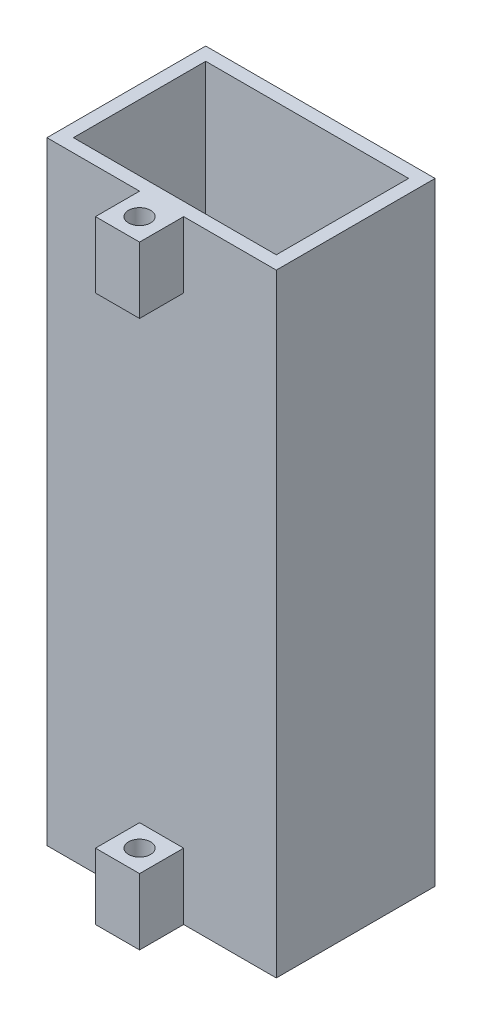
ISO-10303-21;
HEADER;
FILE_DESCRIPTION(('STEP AP214'),'2;1');
FILE_NAME('part.step','',(''),(''),'','','');
FILE_SCHEMA(('AUTOMOTIVE_DESIGN { 1 0 10303 214 1 1 1 1 }'));
ENDSEC;
DATA;
#1=APPLICATION_CONTEXT('core data for automotive mechanical design processes');
#2=APPLICATION_PROTOCOL_DEFINITION('international standard','automotive_design',2000,#1);
#3=PRODUCT_CONTEXT('',#1,'mechanical');
#4=PRODUCT('Part','Part','',(#3));
#5=PRODUCT_RELATED_PRODUCT_CATEGORY('part','',(#4));
#6=PRODUCT_DEFINITION_FORMATION('','',#4);
#7=PRODUCT_DEFINITION_CONTEXT('part definition',#1,'design');
#8=PRODUCT_DEFINITION('design','',#6,#7);
#9=PRODUCT_DEFINITION_SHAPE('','',#8);
#10=(LENGTH_UNIT() NAMED_UNIT(*) SI_UNIT(.MILLI.,.METRE.));
#11=(NAMED_UNIT(*) PLANE_ANGLE_UNIT() SI_UNIT($,.RADIAN.));
#12=(NAMED_UNIT(*) SI_UNIT($,.STERADIAN.) SOLID_ANGLE_UNIT());
#13=UNCERTAINTY_MEASURE_WITH_UNIT(LENGTH_MEASURE(1.E-05),#10,'distance_accuracy_value','');
#14=(GEOMETRIC_REPRESENTATION_CONTEXT(3) GLOBAL_UNCERTAINTY_ASSIGNED_CONTEXT((#13)) GLOBAL_UNIT_ASSIGNED_CONTEXT((#10,
#11,#12)) REPRESENTATION_CONTEXT('',''));
#15=CARTESIAN_POINT('',(0.,0.,0.));
#16=DIRECTION('',(0.,0.,1.));
#17=DIRECTION('',(1.,0.,0.));
#18=AXIS2_PLACEMENT_3D('',#15,#16,#17);
#19=CARTESIAN_POINT('',(-26.,3.,18.));
#20=DIRECTION('',(0.,0.,-1.));
#21=DIRECTION('',(-1.,0.,0.));
#22=AXIS2_PLACEMENT_3D('',#19,#20,#21);
#23=PLANE('',#22);
#24=DIRECTION('',(0.,1.,0.));
#25=VECTOR('',#24,1.);
#26=CARTESIAN_POINT('',(5.,15.,18.));
#27=LINE('',#26,#25);
#28=CARTESIAN_POINT('',(5.,0.,18.));
#29=VERTEX_POINT('',#28);
#30=CARTESIAN_POINT('',(5.,15.,18.));
#31=VERTEX_POINT('',#30);
#32=EDGE_CURVE('E169',#29,#31,#27,.T.);
#33=ORIENTED_EDGE('',*,*,#32,.F.);
#34=DIRECTION('',(1.,0.,0.));
#35=VECTOR('',#34,1.);
#36=CARTESIAN_POINT('',(-26.,0.,18.));
#37=LINE('',#36,#35);
#38=CARTESIAN_POINT('',(26.,0.,18.));
#39=VERTEX_POINT('',#38);
#40=EDGE_CURVE('E257',#29,#39,#37,.T.);
#41=ORIENTED_EDGE('',*,*,#40,.T.);
#42=DIRECTION('',(0.,-1.,0.));
#43=VECTOR('',#42,1.);
#44=CARTESIAN_POINT('',(26.,3.,18.));
#45=LINE('',#44,#43);
#46=CARTESIAN_POINT('',(26.,139.,18.));
#47=VERTEX_POINT('',#46);
#48=EDGE_CURVE('E44',#47,#39,#45,.T.);
#49=ORIENTED_EDGE('',*,*,#48,.F.);
#50=DIRECTION('',(1.,0.,0.));
#51=VECTOR('',#50,1.);
#52=CARTESIAN_POINT('',(0.,139.,18.));
#53=LINE('',#52,#51);
#54=CARTESIAN_POINT('',(5.,139.,18.));
#55=VERTEX_POINT('',#54);
#56=EDGE_CURVE('E235',#55,#47,#53,.T.);
#57=ORIENTED_EDGE('',*,*,#56,.F.);
#58=DIRECTION('',(0.,1.,0.));
#59=VECTOR('',#58,1.);
#60=CARTESIAN_POINT('',(5.,124.,18.));
#61=LINE('',#60,#59);
#62=CARTESIAN_POINT('',(5.,124.,18.));
#63=VERTEX_POINT('',#62);
#64=EDGE_CURVE('E170',#63,#55,#61,.T.);
#65=ORIENTED_EDGE('',*,*,#64,.F.);
#66=DIRECTION('',(1.,0.,0.));
#67=VECTOR('',#66,1.);
#68=CARTESIAN_POINT('',(-5.,124.,18.));
#69=LINE('',#68,#67);
#70=CARTESIAN_POINT('',(-5.,124.,18.));
#71=VERTEX_POINT('',#70);
#72=EDGE_CURVE('E183',#71,#63,#69,.T.);
#73=ORIENTED_EDGE('',*,*,#72,.F.);
#74=DIRECTION('',(0.,-1.,0.));
#75=VECTOR('',#74,1.);
#76=CARTESIAN_POINT('',(-5.,124.,18.));
#77=LINE('',#76,#75);
#78=CARTESIAN_POINT('',(-5.,139.,18.));
#79=VERTEX_POINT('',#78);
#80=EDGE_CURVE('E173',#79,#71,#77,.T.);
#81=ORIENTED_EDGE('',*,*,#80,.F.);
#82=CARTESIAN_POINT('',(-26.,139.,18.));
#83=VERTEX_POINT('',#82);
#84=EDGE_CURVE('E236',#83,#79,#53,.T.);
#85=ORIENTED_EDGE('',*,*,#84,.F.);
#86=DIRECTION('',(0.,-1.,0.));
#87=VECTOR('',#86,1.);
#88=CARTESIAN_POINT('',(-26.,3.,18.));
#89=LINE('',#88,#87);
#90=CARTESIAN_POINT('',(-26.,0.,18.));
#91=VERTEX_POINT('',#90);
#92=EDGE_CURVE('E11',#83,#91,#89,.T.);
#93=ORIENTED_EDGE('',*,*,#92,.T.);
#94=CARTESIAN_POINT('',(-5.00000000000001,0.,18.));
#95=VERTEX_POINT('',#94);
#96=EDGE_CURVE('E258',#91,#95,#37,.T.);
#97=ORIENTED_EDGE('',*,*,#96,.T.);
#98=DIRECTION('',(0.,-1.,0.));
#99=VECTOR('',#98,1.);
#100=CARTESIAN_POINT('',(-5.,15.,18.));
#101=LINE('',#100,#99);
#102=CARTESIAN_POINT('',(-5.,15.,18.));
#103=VERTEX_POINT('',#102);
#104=EDGE_CURVE('E57',#103,#95,#101,.T.);
#105=ORIENTED_EDGE('',*,*,#104,.F.);
#106=DIRECTION('',(-1.,0.,0.));
#107=VECTOR('',#106,1.);
#108=CARTESIAN_POINT('',(-5.,15.,18.));
#109=LINE('',#108,#107);
#110=EDGE_CURVE('E52',#31,#103,#109,.T.);
#111=ORIENTED_EDGE('',*,*,#110,.F.);
#112=EDGE_LOOP('',(#33,#41,#49,#57,#65,#73,#81,#85,#93,#97,#105,#111));
#113=FACE_BOUND('',#112,.T.);
#114=ADVANCED_FACE('F35',(#113),#23,.F.);
#115=CARTESIAN_POINT('',(-26.,3.,18.));
#116=DIRECTION('',(-1.,0.,0.));
#117=DIRECTION('',(0.,0.,1.));
#118=AXIS2_PLACEMENT_3D('',#115,#116,#117);
#119=PLANE('',#118);
#120=DIRECTION('',(0.,0.,-1.));
#121=VECTOR('',#120,1.);
#122=CARTESIAN_POINT('',(-26.,0.,18.));
#123=LINE('',#122,#121);
#124=CARTESIAN_POINT('',(-26.,0.,-18.));
#125=VERTEX_POINT('',#124);
#126=EDGE_CURVE('E248',#91,#125,#123,.T.);
#127=ORIENTED_EDGE('',*,*,#126,.F.);
#128=ORIENTED_EDGE('',*,*,#92,.F.);
#129=DIRECTION('',(0.,0.,1.));
#130=VECTOR('',#129,1.);
#131=CARTESIAN_POINT('',(-26.,139.,0.));
#132=LINE('',#131,#130);
#133=CARTESIAN_POINT('',(-26.,139.,-18.));
#134=VERTEX_POINT('',#133);
#135=EDGE_CURVE('E245',#134,#83,#132,.T.);
#136=ORIENTED_EDGE('',*,*,#135,.F.);
#137=DIRECTION('',(0.,-1.,0.));
#138=VECTOR('',#137,1.);
#139=CARTESIAN_POINT('',(-26.,3.,-18.));
#140=LINE('',#139,#138);
#141=EDGE_CURVE('E259',#134,#125,#140,.T.);
#142=ORIENTED_EDGE('',*,*,#141,.T.);
#143=EDGE_LOOP('',(#127,#128,#136,#142));
#144=FACE_BOUND('',#143,.T.);
#145=ADVANCED_FACE('F37',(#144),#119,.T.);
#146=CARTESIAN_POINT('',(26.,3.,18.));
#147=DIRECTION('',(-1.,0.,0.));
#148=DIRECTION('',(0.,0.,1.));
#149=AXIS2_PLACEMENT_3D('',#146,#147,#148);
#150=PLANE('',#149);
#151=DIRECTION('',(0.,0.,-1.));
#152=VECTOR('',#151,1.);
#153=CARTESIAN_POINT('',(26.,0.,18.));
#154=LINE('',#153,#152);
#155=CARTESIAN_POINT('',(26.,0.,-18.));
#156=VERTEX_POINT('',#155);
#157=EDGE_CURVE('E254',#39,#156,#154,.T.);
#158=ORIENTED_EDGE('',*,*,#157,.T.);
#159=DIRECTION('',(0.,-1.,0.));
#160=VECTOR('',#159,1.);
#161=CARTESIAN_POINT('',(26.,3.,-18.));
#162=LINE('',#161,#160);
#163=CARTESIAN_POINT('',(26.,139.,-18.));
#164=VERTEX_POINT('',#163);
#165=EDGE_CURVE('E263',#164,#156,#162,.T.);
#166=ORIENTED_EDGE('',*,*,#165,.F.);
#167=DIRECTION('',(0.,0.,-1.));
#168=VECTOR('',#167,1.);
#169=CARTESIAN_POINT('',(26.,139.,0.));
#170=LINE('',#169,#168);
#171=EDGE_CURVE('E239',#47,#164,#170,.T.);
#172=ORIENTED_EDGE('',*,*,#171,.F.);
#173=ORIENTED_EDGE('',*,*,#48,.T.);
#174=EDGE_LOOP('',(#158,#166,#172,#173));
#175=FACE_BOUND('',#174,.T.);
#176=ADVANCED_FACE('F319',(#175),#150,.F.);
#177=CARTESIAN_POINT('',(-26.,3.,-18.));
#178=DIRECTION('',(0.,0.,-1.));
#179=DIRECTION('',(-1.,0.,0.));
#180=AXIS2_PLACEMENT_3D('',#177,#178,#179);
#181=PLANE('',#180);
#182=DIRECTION('',(1.,0.,0.));
#183=VECTOR('',#182,1.);
#184=CARTESIAN_POINT('',(-26.,0.,-18.));
#185=LINE('',#184,#183);
#186=EDGE_CURVE('E251',#125,#156,#185,.T.);
#187=ORIENTED_EDGE('',*,*,#186,.F.);
#188=ORIENTED_EDGE('',*,*,#141,.F.);
#189=DIRECTION('',(-1.,0.,0.));
#190=VECTOR('',#189,1.);
#191=CARTESIAN_POINT('',(0.,139.,-18.));
#192=LINE('',#191,#190);
#193=EDGE_CURVE('E242',#164,#134,#192,.T.);
#194=ORIENTED_EDGE('',*,*,#193,.F.);
#195=ORIENTED_EDGE('',*,*,#165,.T.);
#196=EDGE_LOOP('',(#187,#188,#194,#195));
#197=FACE_BOUND('',#196,.T.);
#198=ADVANCED_FACE('F270',(#197),#181,.T.);
#199=CARTESIAN_POINT('',(0.,0.,0.));
#200=DIRECTION('',(0.,-1.,0.));
#201=DIRECTION('',(0.,0.,-1.));
#202=AXIS2_PLACEMENT_3D('',#199,#200,#201);
#203=PLANE('',#202);
#204=CARTESIAN_POINT('',(0.,0.,23.));
#205=DIRECTION('',(0.,1.,0.));
#206=DIRECTION('',(0.,0.,1.));
#207=AXIS2_PLACEMENT_3D('',#204,#205,#206);
#208=CIRCLE('',#207,2.5);
#209=CARTESIAN_POINT('',(0.,0.,25.5));
#210=VERTEX_POINT('',#209);
#211=EDGE_CURVE('E296',#210,#210,#208,.T.);
#212=ORIENTED_EDGE('',*,*,#211,.T.);
#213=EDGE_LOOP('',(#212));
#214=FACE_BOUND('',#213,.T.);
#215=ORIENTED_EDGE('',*,*,#126,.T.);
#216=ORIENTED_EDGE('',*,*,#186,.T.);
#217=ORIENTED_EDGE('',*,*,#157,.F.);
#218=ORIENTED_EDGE('',*,*,#40,.F.);
#219=DIRECTION('',(0.,0.,-1.));
#220=VECTOR('',#219,1.);
#221=CARTESIAN_POINT('',(5.,0.,28.));
#222=LINE('',#221,#220);
#223=CARTESIAN_POINT('',(5.,0.,28.));
#224=VERTEX_POINT('',#223);
#225=EDGE_CURVE('E284',#224,#29,#222,.T.);
#226=ORIENTED_EDGE('',*,*,#225,.F.);
#227=DIRECTION('',(1.,0.,0.));
#228=VECTOR('',#227,1.);
#229=CARTESIAN_POINT('',(-5.,0.,28.));
#230=LINE('',#229,#228);
#231=CARTESIAN_POINT('',(-5.,0.,28.));
#232=VERTEX_POINT('',#231);
#233=EDGE_CURVE('E163',#232,#224,#230,.T.);
#234=ORIENTED_EDGE('',*,*,#233,.F.);
#235=DIRECTION('',(0.,0.,-1.));
#236=VECTOR('',#235,1.);
#237=CARTESIAN_POINT('',(-5.,0.,28.));
#238=LINE('',#237,#236);
#239=EDGE_CURVE('E175',#232,#95,#238,.T.);
#240=ORIENTED_EDGE('',*,*,#239,.T.);
#241=ORIENTED_EDGE('',*,*,#96,.F.);
#242=EDGE_LOOP('',(#215,#216,#217,#218,#226,#234,#240,#241));
#243=FACE_BOUND('',#242,.T.);
#244=ADVANCED_FACE('F274',(#214,#243),#203,.T.);
#245=CARTESIAN_POINT('',(0.,139.,0.));
#246=DIRECTION('',(0.,1.,0.));
#247=DIRECTION('',(0.,0.,1.));
#248=AXIS2_PLACEMENT_3D('',#245,#246,#247);
#249=PLANE('',#248);
#250=CARTESIAN_POINT('',(0.,139.,23.));
#251=DIRECTION('',(0.,1.,0.));
#252=DIRECTION('',(0.,0.,1.));
#253=AXIS2_PLACEMENT_3D('',#250,#251,#252);
#254=CIRCLE('',#253,2.5);
#255=CARTESIAN_POINT('',(0.,139.,25.5));
#256=VERTEX_POINT('',#255);
#257=EDGE_CURVE('E287',#256,#256,#254,.T.);
#258=ORIENTED_EDGE('',*,*,#257,.F.);
#259=EDGE_LOOP('',(#258));
#260=FACE_BOUND('',#259,.T.);
#261=ORIENTED_EDGE('',*,*,#84,.T.);
#262=DIRECTION('',(0.,0.,-1.));
#263=VECTOR('',#262,1.);
#264=CARTESIAN_POINT('',(-5.,139.,28.));
#265=LINE('',#264,#263);
#266=CARTESIAN_POINT('',(-5.,139.,28.));
#267=VERTEX_POINT('',#266);
#268=EDGE_CURVE('E199',#267,#79,#265,.T.);
#269=ORIENTED_EDGE('',*,*,#268,.F.);
#270=DIRECTION('',(-1.,0.,0.));
#271=VECTOR('',#270,1.);
#272=CARTESIAN_POINT('',(-5.,139.,28.));
#273=LINE('',#272,#271);
#274=CARTESIAN_POINT('',(5.,139.,28.));
#275=VERTEX_POINT('',#274);
#276=EDGE_CURVE('E182',#275,#267,#273,.T.);
#277=ORIENTED_EDGE('',*,*,#276,.F.);
#278=DIRECTION('',(0.,0.,-1.));
#279=VECTOR('',#278,1.);
#280=CARTESIAN_POINT('',(5.,139.,28.));
#281=LINE('',#280,#279);
#282=EDGE_CURVE('E202',#275,#55,#281,.T.);
#283=ORIENTED_EDGE('',*,*,#282,.T.);
#284=ORIENTED_EDGE('',*,*,#56,.T.);
#285=ORIENTED_EDGE('',*,*,#171,.T.);
#286=ORIENTED_EDGE('',*,*,#193,.T.);
#287=ORIENTED_EDGE('',*,*,#135,.T.);
#288=EDGE_LOOP('',(#261,#269,#277,#283,#284,#285,#286,#287));
#289=FACE_BOUND('',#288,.T.);
#290=DIRECTION('',(0.,0.,-1.));
#291=VECTOR('',#290,1.);
#292=CARTESIAN_POINT('',(23.,139.,0.));
#293=LINE('',#292,#291);
#294=CARTESIAN_POINT('',(23.,139.,15.));
#295=VERTEX_POINT('',#294);
#296=CARTESIAN_POINT('',(23.,139.,-15.));
#297=VERTEX_POINT('',#296);
#298=EDGE_CURVE('E208',#295,#297,#293,.T.);
#299=ORIENTED_EDGE('',*,*,#298,.F.);
#300=DIRECTION('',(1.,0.,0.));
#301=VECTOR('',#300,1.);
#302=CARTESIAN_POINT('',(0.,139.,15.));
#303=LINE('',#302,#301);
#304=CARTESIAN_POINT('',(-23.,139.,15.));
#305=VERTEX_POINT('',#304);
#306=EDGE_CURVE('E206',#305,#295,#303,.T.);
#307=ORIENTED_EDGE('',*,*,#306,.F.);
#308=DIRECTION('',(0.,0.,1.));
#309=VECTOR('',#308,1.);
#310=CARTESIAN_POINT('',(-23.,139.,0.));
#311=LINE('',#310,#309);
#312=CARTESIAN_POINT('',(-23.,139.,-15.));
#313=VERTEX_POINT('',#312);
#314=EDGE_CURVE('E214',#313,#305,#311,.T.);
#315=ORIENTED_EDGE('',*,*,#314,.F.);
#316=DIRECTION('',(-1.,0.,0.));
#317=VECTOR('',#316,1.);
#318=CARTESIAN_POINT('',(0.,139.,-15.));
#319=LINE('',#318,#317);
#320=EDGE_CURVE('E211',#297,#313,#319,.T.);
#321=ORIENTED_EDGE('',*,*,#320,.F.);
#322=EDGE_LOOP('',(#299,#307,#315,#321));
#323=FACE_BOUND('',#322,.T.);
#324=ADVANCED_FACE('F329',(#260,#289,#323),#249,.T.);
#325=CARTESIAN_POINT('',(0.,139.,15.));
#326=DIRECTION('',(0.,0.,-1.));
#327=DIRECTION('',(-1.,0.,0.));
#328=AXIS2_PLACEMENT_3D('',#325,#326,#327);
#329=PLANE('',#328);
#330=DIRECTION('',(1.,0.,0.));
#331=VECTOR('',#330,1.);
#332=CARTESIAN_POINT('',(0.,3.,15.));
#333=LINE('',#332,#331);
#334=CARTESIAN_POINT('',(-23.,3.,15.));
#335=VERTEX_POINT('',#334);
#336=CARTESIAN_POINT('',(23.,3.,15.));
#337=VERTEX_POINT('',#336);
#338=EDGE_CURVE('E205',#335,#337,#333,.T.);
#339=ORIENTED_EDGE('',*,*,#338,.F.);
#340=DIRECTION('',(0.,-1.,0.));
#341=VECTOR('',#340,1.);
#342=CARTESIAN_POINT('',(-23.,139.,15.));
#343=LINE('',#342,#341);
#344=EDGE_CURVE('E216',#305,#335,#343,.T.);
#345=ORIENTED_EDGE('',*,*,#344,.F.);
#346=ORIENTED_EDGE('',*,*,#306,.T.);
#347=DIRECTION('',(0.,-1.,0.));
#348=VECTOR('',#347,1.);
#349=CARTESIAN_POINT('',(23.,139.,15.));
#350=LINE('',#349,#348);
#351=EDGE_CURVE('E232',#295,#337,#350,.T.);
#352=ORIENTED_EDGE('',*,*,#351,.T.);
#353=EDGE_LOOP('',(#339,#345,#346,#352));
#354=FACE_BOUND('',#353,.T.);
#355=ADVANCED_FACE('F333',(#354),#329,.T.);
#356=CARTESIAN_POINT('',(23.,139.,0.));
#357=DIRECTION('',(-1.,0.,0.));
#358=DIRECTION('',(0.,0.,1.));
#359=AXIS2_PLACEMENT_3D('',#356,#357,#358);
#360=PLANE('',#359);
#361=DIRECTION('',(0.,0.,-1.));
#362=VECTOR('',#361,1.);
#363=CARTESIAN_POINT('',(23.,3.,0.));
#364=LINE('',#363,#362);
#365=CARTESIAN_POINT('',(23.,3.,-15.));
#366=VERTEX_POINT('',#365);
#367=EDGE_CURVE('E219',#337,#366,#364,.T.);
#368=ORIENTED_EDGE('',*,*,#367,.F.);
#369=ORIENTED_EDGE('',*,*,#351,.F.);
#370=ORIENTED_EDGE('',*,*,#298,.T.);
#371=DIRECTION('',(0.,-1.,0.));
#372=VECTOR('',#371,1.);
#373=CARTESIAN_POINT('',(23.,139.,-15.));
#374=LINE('',#373,#372);
#375=EDGE_CURVE('E230',#297,#366,#374,.T.);
#376=ORIENTED_EDGE('',*,*,#375,.T.);
#377=EDGE_LOOP('',(#368,#369,#370,#376));
#378=FACE_BOUND('',#377,.T.);
#379=ADVANCED_FACE('F339',(#378),#360,.T.);
#380=CARTESIAN_POINT('',(0.,139.,-15.));
#381=DIRECTION('',(0.,0.,1.));
#382=DIRECTION('',(1.,0.,0.));
#383=AXIS2_PLACEMENT_3D('',#380,#381,#382);
#384=PLANE('',#383);
#385=DIRECTION('',(-1.,0.,0.));
#386=VECTOR('',#385,1.);
#387=CARTESIAN_POINT('',(0.,3.,-15.));
#388=LINE('',#387,#386);
#389=CARTESIAN_POINT('',(-23.,3.,-15.));
#390=VERTEX_POINT('',#389);
#391=EDGE_CURVE('E222',#366,#390,#388,.T.);
#392=ORIENTED_EDGE('',*,*,#391,.F.);
#393=ORIENTED_EDGE('',*,*,#375,.F.);
#394=ORIENTED_EDGE('',*,*,#320,.T.);
#395=DIRECTION('',(0.,-1.,0.));
#396=VECTOR('',#395,1.);
#397=CARTESIAN_POINT('',(-23.,139.,-15.));
#398=LINE('',#397,#396);
#399=EDGE_CURVE('E228',#313,#390,#398,.T.);
#400=ORIENTED_EDGE('',*,*,#399,.T.);
#401=EDGE_LOOP('',(#392,#393,#394,#400));
#402=FACE_BOUND('',#401,.T.);
#403=ADVANCED_FACE('F356',(#402),#384,.T.);
#404=CARTESIAN_POINT('',(-23.,139.,0.));
#405=DIRECTION('',(1.,0.,0.));
#406=DIRECTION('',(0.,0.,-1.));
#407=AXIS2_PLACEMENT_3D('',#404,#405,#406);
#408=PLANE('',#407);
#409=DIRECTION('',(0.,0.,1.));
#410=VECTOR('',#409,1.);
#411=CARTESIAN_POINT('',(-23.,3.,0.));
#412=LINE('',#411,#410);
#413=EDGE_CURVE('E209',#390,#335,#412,.T.);
#414=ORIENTED_EDGE('',*,*,#413,.F.);
#415=ORIENTED_EDGE('',*,*,#399,.F.);
#416=ORIENTED_EDGE('',*,*,#314,.T.);
#417=ORIENTED_EDGE('',*,*,#344,.T.);
#418=EDGE_LOOP('',(#414,#415,#416,#417));
#419=FACE_BOUND('',#418,.T.);
#420=ADVANCED_FACE('F347',(#419),#408,.T.);
#421=CARTESIAN_POINT('',(0.,3.,0.));
#422=DIRECTION('',(0.,-1.,0.));
#423=DIRECTION('',(0.,0.,-1.));
#424=AXIS2_PLACEMENT_3D('',#421,#422,#423);
#425=PLANE('',#424);
#426=ORIENTED_EDGE('',*,*,#413,.T.);
#427=ORIENTED_EDGE('',*,*,#338,.T.);
#428=ORIENTED_EDGE('',*,*,#367,.T.);
#429=ORIENTED_EDGE('',*,*,#391,.T.);
#430=EDGE_LOOP('',(#426,#427,#428,#429));
#431=FACE_BOUND('',#430,.T.);
#432=ADVANCED_FACE('F344',(#431),#425,.F.);
#433=CARTESIAN_POINT('',(5.,124.,28.));
#434=DIRECTION('',(-1.,0.,0.));
#435=DIRECTION('',(0.,0.,1.));
#436=AXIS2_PLACEMENT_3D('',#433,#434,#435);
#437=PLANE('',#436);
#438=ORIENTED_EDGE('',*,*,#64,.T.);
#439=ORIENTED_EDGE('',*,*,#282,.F.);
#440=DIRECTION('',(0.,1.,0.));
#441=VECTOR('',#440,1.);
#442=CARTESIAN_POINT('',(5.,124.,28.));
#443=LINE('',#442,#441);
#444=CARTESIAN_POINT('',(5.,124.,28.));
#445=VERTEX_POINT('',#444);
#446=EDGE_CURVE('E179',#445,#275,#443,.T.);
#447=ORIENTED_EDGE('',*,*,#446,.F.);
#448=DIRECTION('',(0.,0.,-1.));
#449=VECTOR('',#448,1.);
#450=CARTESIAN_POINT('',(5.,124.,28.));
#451=LINE('',#450,#449);
#452=EDGE_CURVE('E188',#445,#63,#451,.T.);
#453=ORIENTED_EDGE('',*,*,#452,.T.);
#454=EDGE_LOOP('',(#438,#439,#447,#453));
#455=FACE_BOUND('',#454,.T.);
#456=ADVANCED_FACE('F346',(#455),#437,.F.);
#457=CARTESIAN_POINT('',(-5.,124.,28.));
#458=DIRECTION('',(1.,0.,0.));
#459=DIRECTION('',(0.,0.,-1.));
#460=AXIS2_PLACEMENT_3D('',#457,#458,#459);
#461=PLANE('',#460);
#462=ORIENTED_EDGE('',*,*,#80,.T.);
#463=DIRECTION('',(0.,0.,-1.));
#464=VECTOR('',#463,1.);
#465=CARTESIAN_POINT('',(-5.,124.,28.));
#466=LINE('',#465,#464);
#467=CARTESIAN_POINT('',(-5.,124.,28.));
#468=VERTEX_POINT('',#467);
#469=EDGE_CURVE('E196',#468,#71,#466,.T.);
#470=ORIENTED_EDGE('',*,*,#469,.F.);
#471=DIRECTION('',(0.,-1.,0.));
#472=VECTOR('',#471,1.);
#473=CARTESIAN_POINT('',(-5.,124.,28.));
#474=LINE('',#473,#472);
#475=EDGE_CURVE('E185',#267,#468,#474,.T.);
#476=ORIENTED_EDGE('',*,*,#475,.F.);
#477=ORIENTED_EDGE('',*,*,#268,.T.);
#478=EDGE_LOOP('',(#462,#470,#476,#477));
#479=FACE_BOUND('',#478,.T.);
#480=ADVANCED_FACE('F353',(#479),#461,.F.);
#481=CARTESIAN_POINT('',(-5.,124.,28.));
#482=DIRECTION('',(0.,1.,0.));
#483=DIRECTION('',(0.,0.,1.));
#484=AXIS2_PLACEMENT_3D('',#481,#482,#483);
#485=PLANE('',#484);
#486=CARTESIAN_POINT('',(0.,124.,23.));
#487=DIRECTION('',(0.,1.,0.));
#488=DIRECTION('',(0.,0.,1.));
#489=AXIS2_PLACEMENT_3D('',#486,#487,#488);
#490=CIRCLE('',#489,2.5);
#491=CARTESIAN_POINT('',(0.,124.,25.5));
#492=VERTEX_POINT('',#491);
#493=EDGE_CURVE('E289',#492,#492,#490,.T.);
#494=ORIENTED_EDGE('',*,*,#493,.T.);
#495=EDGE_LOOP('',(#494));
#496=FACE_BOUND('',#495,.T.);
#497=ORIENTED_EDGE('',*,*,#72,.T.);
#498=ORIENTED_EDGE('',*,*,#452,.F.);
#499=DIRECTION('',(1.,0.,0.));
#500=VECTOR('',#499,1.);
#501=CARTESIAN_POINT('',(-5.,124.,28.));
#502=LINE('',#501,#500);
#503=EDGE_CURVE('E187',#468,#445,#502,.T.);
#504=ORIENTED_EDGE('',*,*,#503,.F.);
#505=ORIENTED_EDGE('',*,*,#469,.T.);
#506=EDGE_LOOP('',(#497,#498,#504,#505));
#507=FACE_BOUND('',#506,.T.);
#508=ADVANCED_FACE('F380',(#496,#507),#485,.F.);
#509=CARTESIAN_POINT('',(0.,0.,28.));
#510=DIRECTION('',(0.,0.,-1.));
#511=DIRECTION('',(-1.,0.,0.));
#512=AXIS2_PLACEMENT_3D('',#509,#510,#511);
#513=PLANE('',#512);
#514=ORIENTED_EDGE('',*,*,#446,.T.);
#515=ORIENTED_EDGE('',*,*,#276,.T.);
#516=ORIENTED_EDGE('',*,*,#475,.T.);
#517=ORIENTED_EDGE('',*,*,#503,.T.);
#518=EDGE_LOOP('',(#514,#515,#516,#517));
#519=FACE_BOUND('',#518,.T.);
#520=ADVANCED_FACE('F384',(#519),#513,.F.);
#521=CARTESIAN_POINT('',(5.,15.,28.));
#522=DIRECTION('',(-1.,0.,0.));
#523=DIRECTION('',(0.,0.,1.));
#524=AXIS2_PLACEMENT_3D('',#521,#522,#523);
#525=PLANE('',#524);
#526=ORIENTED_EDGE('',*,*,#32,.T.);
#527=DIRECTION('',(0.,0.,-1.));
#528=VECTOR('',#527,1.);
#529=CARTESIAN_POINT('',(5.,15.,28.));
#530=LINE('',#529,#528);
#531=CARTESIAN_POINT('',(5.,15.,28.));
#532=VERTEX_POINT('',#531);
#533=EDGE_CURVE('E151',#532,#31,#530,.T.);
#534=ORIENTED_EDGE('',*,*,#533,.F.);
#535=DIRECTION('',(0.,1.,0.));
#536=VECTOR('',#535,1.);
#537=CARTESIAN_POINT('',(5.,15.,28.));
#538=LINE('',#537,#536);
#539=EDGE_CURVE('E158',#224,#532,#538,.T.);
#540=ORIENTED_EDGE('',*,*,#539,.F.);
#541=ORIENTED_EDGE('',*,*,#225,.T.);
#542=EDGE_LOOP('',(#526,#534,#540,#541));
#543=FACE_BOUND('',#542,.T.);
#544=ADVANCED_FACE('F168',(#543),#525,.F.);
#545=CARTESIAN_POINT('',(-5.,15.,28.));
#546=DIRECTION('',(0.,-1.,0.));
#547=DIRECTION('',(0.,0.,-1.));
#548=AXIS2_PLACEMENT_3D('',#545,#546,#547);
#549=PLANE('',#548);
#550=CARTESIAN_POINT('',(0.,15.,23.));
#551=DIRECTION('',(0.,-1.,0.));
#552=DIRECTION('',(0.,0.,-1.));
#553=AXIS2_PLACEMENT_3D('',#550,#551,#552);
#554=CIRCLE('',#553,2.5);
#555=CARTESIAN_POINT('',(0.,15.,20.5));
#556=VERTEX_POINT('',#555);
#557=EDGE_CURVE('E39',#556,#556,#554,.T.);
#558=ORIENTED_EDGE('',*,*,#557,.T.);
#559=EDGE_LOOP('',(#558));
#560=FACE_BOUND('',#559,.T.);
#561=ORIENTED_EDGE('',*,*,#110,.T.);
#562=DIRECTION('',(0.,0.,-1.));
#563=VECTOR('',#562,1.);
#564=CARTESIAN_POINT('',(-5.,15.,28.));
#565=LINE('',#564,#563);
#566=CARTESIAN_POINT('',(-5.,15.,28.));
#567=VERTEX_POINT('',#566);
#568=EDGE_CURVE('E154',#567,#103,#565,.T.);
#569=ORIENTED_EDGE('',*,*,#568,.F.);
#570=DIRECTION('',(-1.,0.,0.));
#571=VECTOR('',#570,1.);
#572=CARTESIAN_POINT('',(-5.,15.,28.));
#573=LINE('',#572,#571);
#574=EDGE_CURVE('E147',#532,#567,#573,.T.);
#575=ORIENTED_EDGE('',*,*,#574,.F.);
#576=ORIENTED_EDGE('',*,*,#533,.T.);
#577=EDGE_LOOP('',(#561,#569,#575,#576));
#578=FACE_BOUND('',#577,.T.);
#579=ADVANCED_FACE('F149',(#560,#578),#549,.F.);
#580=CARTESIAN_POINT('',(-5.,15.,28.));
#581=DIRECTION('',(1.,0.,0.));
#582=DIRECTION('',(0.,0.,-1.));
#583=AXIS2_PLACEMENT_3D('',#580,#581,#582);
#584=PLANE('',#583);
#585=ORIENTED_EDGE('',*,*,#104,.T.);
#586=ORIENTED_EDGE('',*,*,#239,.F.);
#587=DIRECTION('',(0.,-1.,0.));
#588=VECTOR('',#587,1.);
#589=CARTESIAN_POINT('',(-5.,15.,28.));
#590=LINE('',#589,#588);
#591=EDGE_CURVE('E157',#567,#232,#590,.T.);
#592=ORIENTED_EDGE('',*,*,#591,.F.);
#593=ORIENTED_EDGE('',*,*,#568,.T.);
#594=EDGE_LOOP('',(#585,#586,#592,#593));
#595=FACE_BOUND('',#594,.T.);
#596=ADVANCED_FACE('F279',(#595),#584,.F.);
#597=CARTESIAN_POINT('',(0.,0.,28.));
#598=DIRECTION('',(0.,0.,1.));
#599=DIRECTION('',(1.,0.,0.));
#600=AXIS2_PLACEMENT_3D('',#597,#598,#599);
#601=PLANE('',#600);
#602=ORIENTED_EDGE('',*,*,#539,.T.);
#603=ORIENTED_EDGE('',*,*,#574,.T.);
#604=ORIENTED_EDGE('',*,*,#591,.T.);
#605=ORIENTED_EDGE('',*,*,#233,.T.);
#606=EDGE_LOOP('',(#602,#603,#604,#605));
#607=FACE_BOUND('',#606,.T.);
#608=ADVANCED_FACE('F161',(#607),#601,.T.);
#609=CARTESIAN_POINT('',(0.,0.,23.));
#610=DIRECTION('',(0.,1.,0.));
#611=DIRECTION('',(0.,0.,1.));
#612=AXIS2_PLACEMENT_3D('',#609,#610,#611);
#613=CYLINDRICAL_SURFACE('',#612,2.5);
#614=ORIENTED_EDGE('',*,*,#211,.F.);
#615=EDGE_LOOP('',(#614));
#616=FACE_BOUND('',#615,.T.);
#617=ORIENTED_EDGE('',*,*,#557,.F.);
#618=EDGE_LOOP('',(#617));
#619=FACE_BOUND('',#618,.T.);
#620=ADVANCED_FACE('F304',(#616,#619),#613,.F.);
#621=ORIENTED_EDGE('',*,*,#257,.T.);
#622=EDGE_LOOP('',(#621));
#623=FACE_BOUND('',#622,.T.);
#624=ORIENTED_EDGE('',*,*,#493,.F.);
#625=EDGE_LOOP('',(#624));
#626=FACE_BOUND('',#625,.T.);
#627=ADVANCED_FACE('F306',(#623,#626),#613,.F.);
#628=CLOSED_SHELL('',(#114,#145,#176,#198,#244,#324,#355,#379,#403,#420,#432,#456,#480,#508,
#520,#544,#579,#596,#608,#620,#627));
#629=MANIFOLD_SOLID_BREP('B2',#628);
#630=ADVANCED_BREP_SHAPE_REPRESENTATION('',(#18,#629),#14);
#631=SHAPE_DEFINITION_REPRESENTATION(#9,#630);
ENDSEC;
END-ISO-10303-21;
